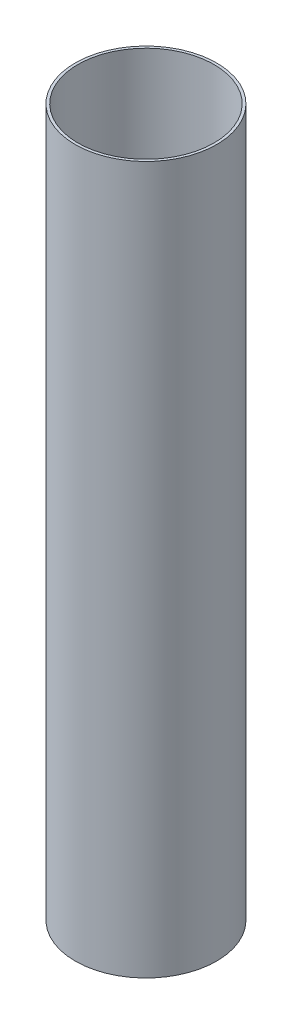
ISO-10303-21;
HEADER;
FILE_DESCRIPTION(('STEP AP214'),'2;1');
FILE_NAME('part.step','',(''),(''),'','','');
FILE_SCHEMA(('AUTOMOTIVE_DESIGN { 1 0 10303 214 1 1 1 1 }'));
ENDSEC;
DATA;
#1=APPLICATION_CONTEXT('core data for automotive mechanical design processes');
#2=APPLICATION_PROTOCOL_DEFINITION('international standard','automotive_design',2000,#1);
#3=PRODUCT_CONTEXT('',#1,'mechanical');
#4=PRODUCT('Part','Part','',(#3));
#5=PRODUCT_RELATED_PRODUCT_CATEGORY('part','',(#4));
#6=PRODUCT_DEFINITION_FORMATION('','',#4);
#7=PRODUCT_DEFINITION_CONTEXT('part definition',#1,'design');
#8=PRODUCT_DEFINITION('design','',#6,#7);
#9=PRODUCT_DEFINITION_SHAPE('','',#8);
#10=(LENGTH_UNIT() NAMED_UNIT(*) SI_UNIT(.MILLI.,.METRE.));
#11=(NAMED_UNIT(*) PLANE_ANGLE_UNIT() SI_UNIT($,.RADIAN.));
#12=(NAMED_UNIT(*) SI_UNIT($,.STERADIAN.) SOLID_ANGLE_UNIT());
#13=UNCERTAINTY_MEASURE_WITH_UNIT(LENGTH_MEASURE(1.E-05),#10,'distance_accuracy_value','');
#14=(GEOMETRIC_REPRESENTATION_CONTEXT(3) GLOBAL_UNCERTAINTY_ASSIGNED_CONTEXT((#13)) GLOBAL_UNIT_ASSIGNED_CONTEXT((#10,
#11,#12)) REPRESENTATION_CONTEXT('',''));
#15=CARTESIAN_POINT('',(0.,0.,0.));
#16=DIRECTION('',(0.,0.,1.));
#17=DIRECTION('',(1.,0.,0.));
#18=AXIS2_PLACEMENT_3D('',#15,#16,#17);
#19=CARTESIAN_POINT('',(0.,800.,0.));
#20=DIRECTION('',(0.,1.,0.));
#21=DIRECTION('',(0.,0.,1.));
#22=AXIS2_PLACEMENT_3D('',#19,#20,#21);
#23=PLANE('',#22);
#24=CARTESIAN_POINT('',(0.,800.,0.));
#25=DIRECTION('',(0.,1.,0.));
#26=DIRECTION('',(0.,0.,1.));
#27=AXIS2_PLACEMENT_3D('',#24,#25,#26);
#28=CIRCLE('',#27,80.);
#29=CARTESIAN_POINT('',(0.,800.,80.));
#30=VERTEX_POINT('',#29);
#31=EDGE_CURVE('E11',#30,#30,#28,.T.);
#32=ORIENTED_EDGE('',*,*,#31,.T.);
#33=EDGE_LOOP('',(#32));
#34=FACE_BOUND('',#33,.T.);
#35=CARTESIAN_POINT('',(0.,800.,0.));
#36=DIRECTION('',(0.,1.,0.));
#37=DIRECTION('',(1.,0.,0.));
#38=AXIS2_PLACEMENT_3D('',#35,#36,#37);
#39=CIRCLE('',#38,77.);
#40=CARTESIAN_POINT('',(77.,800.,0.));
#41=VERTEX_POINT('',#40);
#42=EDGE_CURVE('E49',#41,#41,#39,.T.);
#43=ORIENTED_EDGE('',*,*,#42,.F.);
#44=EDGE_LOOP('',(#43));
#45=FACE_BOUND('',#44,.T.);
#46=ADVANCED_FACE('F38',(#34,#45),#23,.T.);
#47=CARTESIAN_POINT('',(0.,0.,0.));
#48=DIRECTION('',(0.,1.,0.));
#49=DIRECTION('',(0.,0.,1.));
#50=AXIS2_PLACEMENT_3D('',#47,#48,#49);
#51=PLANE('',#50);
#52=CARTESIAN_POINT('',(0.,0.,0.));
#53=DIRECTION('',(0.,1.,0.));
#54=DIRECTION('',(0.,0.,1.));
#55=AXIS2_PLACEMENT_3D('',#52,#53,#54);
#56=CIRCLE('',#55,80.);
#57=CARTESIAN_POINT('',(0.,0.,80.));
#58=VERTEX_POINT('',#57);
#59=EDGE_CURVE('E42',#58,#58,#56,.T.);
#60=ORIENTED_EDGE('',*,*,#59,.F.);
#61=EDGE_LOOP('',(#60));
#62=FACE_BOUND('',#61,.T.);
#63=CARTESIAN_POINT('',(0.,0.,0.));
#64=DIRECTION('',(0.,1.,0.));
#65=DIRECTION('',(1.,0.,0.));
#66=AXIS2_PLACEMENT_3D('',#63,#64,#65);
#67=CIRCLE('',#66,77.);
#68=CARTESIAN_POINT('',(77.,0.,0.));
#69=VERTEX_POINT('',#68);
#70=EDGE_CURVE('E51',#69,#69,#67,.T.);
#71=ORIENTED_EDGE('',*,*,#70,.T.);
#72=EDGE_LOOP('',(#71));
#73=FACE_BOUND('',#72,.T.);
#74=ADVANCED_FACE('F61',(#62,#73),#51,.F.);
#75=CARTESIAN_POINT('',(0.,800.,0.));
#76=DIRECTION('',(0.,-1.,0.));
#77=DIRECTION('',(0.,0.,-1.));
#78=AXIS2_PLACEMENT_3D('',#75,#76,#77);
#79=CYLINDRICAL_SURFACE('',#78,80.);
#80=ORIENTED_EDGE('',*,*,#31,.F.);
#81=EDGE_LOOP('',(#80));
#82=FACE_BOUND('',#81,.T.);
#83=ORIENTED_EDGE('',*,*,#59,.T.);
#84=EDGE_LOOP('',(#83));
#85=FACE_BOUND('',#84,.T.);
#86=ADVANCED_FACE('F40',(#82,#85),#79,.T.);
#87=CARTESIAN_POINT('',(0.,800.,0.));
#88=DIRECTION('',(0.,-1.,0.));
#89=DIRECTION('',(0.,0.,-1.));
#90=AXIS2_PLACEMENT_3D('',#87,#88,#89);
#91=CYLINDRICAL_SURFACE('',#90,77.);
#92=ORIENTED_EDGE('',*,*,#42,.T.);
#93=EDGE_LOOP('',(#92));
#94=FACE_BOUND('',#93,.T.);
#95=ORIENTED_EDGE('',*,*,#70,.F.);
#96=EDGE_LOOP('',(#95));
#97=FACE_BOUND('',#96,.T.);
#98=ADVANCED_FACE('F57',(#94,#97),#91,.F.);
#99=CLOSED_SHELL('',(#46,#74,#86,#98));
#100=MANIFOLD_SOLID_BREP('B2',#99);
#101=ADVANCED_BREP_SHAPE_REPRESENTATION('',(#18,#100),#14);
#102=SHAPE_DEFINITION_REPRESENTATION(#9,#101);
ENDSEC;
END-ISO-10303-21;
